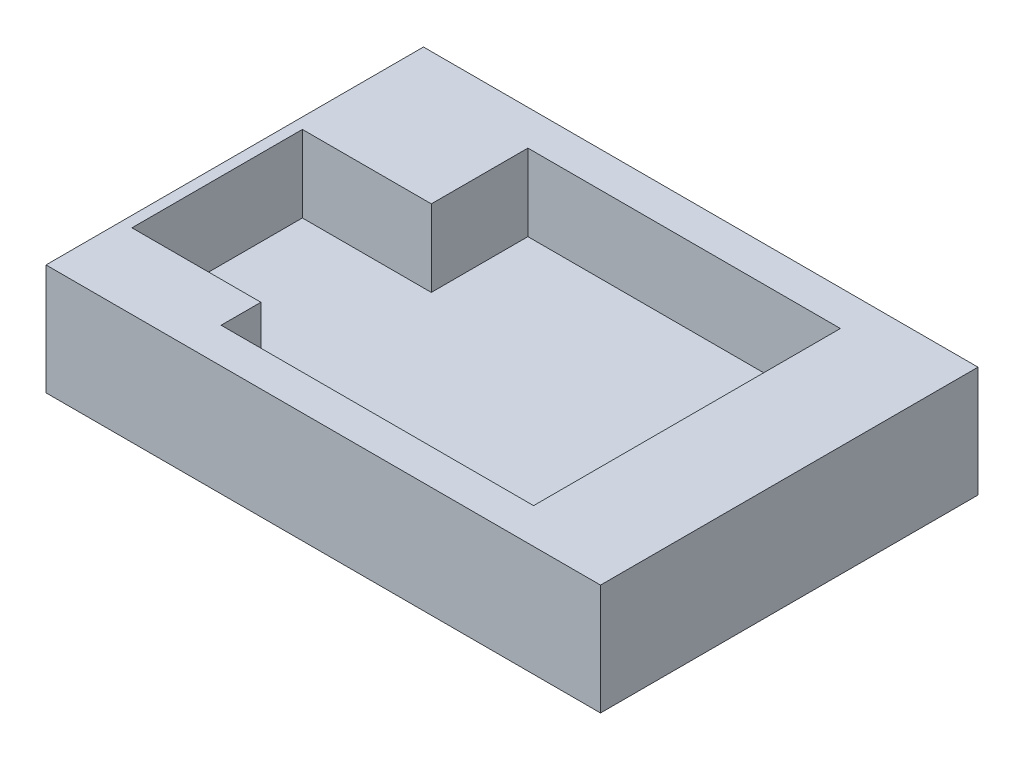
ISO-10303-21;
HEADER;
FILE_DESCRIPTION(('STEP AP214'),'2;1');
FILE_NAME('part.step','',(''),(''),'','','');
FILE_SCHEMA(('AUTOMOTIVE_DESIGN { 1 0 10303 214 1 1 1 1 }'));
ENDSEC;
DATA;
#1=APPLICATION_CONTEXT('core data for automotive mechanical design processes');
#2=APPLICATION_PROTOCOL_DEFINITION('international standard','automotive_design',2000,#1);
#3=PRODUCT_CONTEXT('',#1,'mechanical');
#4=PRODUCT('Part','Part','',(#3));
#5=PRODUCT_RELATED_PRODUCT_CATEGORY('part','',(#4));
#6=PRODUCT_DEFINITION_FORMATION('','',#4);
#7=PRODUCT_DEFINITION_CONTEXT('part definition',#1,'design');
#8=PRODUCT_DEFINITION('design','',#6,#7);
#9=PRODUCT_DEFINITION_SHAPE('','',#8);
#10=(LENGTH_UNIT() NAMED_UNIT(*) SI_UNIT(.MILLI.,.METRE.));
#11=(NAMED_UNIT(*) PLANE_ANGLE_UNIT() SI_UNIT($,.RADIAN.));
#12=(NAMED_UNIT(*) SI_UNIT($,.STERADIAN.) SOLID_ANGLE_UNIT());
#13=UNCERTAINTY_MEASURE_WITH_UNIT(LENGTH_MEASURE(1.E-05),#10,'distance_accuracy_value','');
#14=(GEOMETRIC_REPRESENTATION_CONTEXT(3) GLOBAL_UNCERTAINTY_ASSIGNED_CONTEXT((#13)) GLOBAL_UNIT_ASSIGNED_CONTEXT((#10,
#11,#12)) REPRESENTATION_CONTEXT('',''));
#15=CARTESIAN_POINT('',(0.,0.,0.));
#16=DIRECTION('',(0.,0.,1.));
#17=DIRECTION('',(1.,0.,0.));
#18=AXIS2_PLACEMENT_3D('',#15,#16,#17);
#19=CARTESIAN_POINT('',(-24.2,19.5,0.));
#20=DIRECTION('',(1.,0.,0.));
#21=DIRECTION('',(0.,0.,-1.));
#22=AXIS2_PLACEMENT_3D('',#19,#20,#21);
#23=PLANE('',#22);
#24=DIRECTION('',(0.,1.,0.));
#25=VECTOR('',#24,1.);
#26=CARTESIAN_POINT('',(-24.2,19.5,-10.));
#27=LINE('',#26,#25);
#28=CARTESIAN_POINT('',(-24.2,6.,-10.));
#29=VERTEX_POINT('',#28);
#30=CARTESIAN_POINT('',(-24.2,19.5,-10.));
#31=VERTEX_POINT('',#30);
#32=EDGE_CURVE('E155',#29,#31,#27,.T.);
#33=ORIENTED_EDGE('',*,*,#32,.F.);
#34=DIRECTION('',(0.,0.,1.));
#35=VECTOR('',#34,1.);
#36=CARTESIAN_POINT('',(-24.2,6.,0.));
#37=LINE('',#36,#35);
#38=CARTESIAN_POINT('',(-24.2,6.,-27.));
#39=VERTEX_POINT('',#38);
#40=EDGE_CURVE('E59',#39,#29,#37,.T.);
#41=ORIENTED_EDGE('',*,*,#40,.F.);
#42=DIRECTION('',(0.,-1.,0.));
#43=VECTOR('',#42,1.);
#44=CARTESIAN_POINT('',(-24.2,19.5,-27.));
#45=LINE('',#44,#43);
#46=CARTESIAN_POINT('',(-24.2,19.5,-27.));
#47=VERTEX_POINT('',#46);
#48=EDGE_CURVE('E195',#47,#39,#45,.T.);
#49=ORIENTED_EDGE('',*,*,#48,.F.);
#50=DIRECTION('',(0.,0.,1.));
#51=VECTOR('',#50,1.);
#52=CARTESIAN_POINT('',(-24.2,19.5,0.));
#53=LINE('',#52,#51);
#54=EDGE_CURVE('E166',#47,#31,#53,.T.);
#55=ORIENTED_EDGE('',*,*,#54,.T.);
#56=EDGE_LOOP('',(#33,#41,#49,#55));
#57=FACE_BOUND('',#56,.T.);
#58=ADVANCED_FACE('F36',(#57),#23,.T.);
#59=CARTESIAN_POINT('',(-48.8,6.,-33.218726945));
#60=DIRECTION('',(1.,0.,0.));
#61=DIRECTION('',(0.,0.,-1.));
#62=AXIS2_PLACEMENT_3D('',#59,#60,#61);
#63=PLANE('',#62);
#64=DIRECTION('',(0.,0.,1.));
#65=VECTOR('',#64,1.);
#66=CARTESIAN_POINT('',(-48.8,0.,-33.218726945));
#67=LINE('',#66,#65);
#68=CARTESIAN_POINT('',(-48.8,0.,-33.218726945));
#69=VERTEX_POINT('',#68);
#70=CARTESIAN_POINT('',(-48.8,0.,33.218726945));
#71=VERTEX_POINT('',#70);
#72=EDGE_CURVE('E202',#69,#71,#67,.T.);
#73=ORIENTED_EDGE('',*,*,#72,.T.);
#74=DIRECTION('',(0.,-1.,0.));
#75=VECTOR('',#74,1.);
#76=CARTESIAN_POINT('',(-48.8,6.,33.218726945));
#77=LINE('',#76,#75);
#78=CARTESIAN_POINT('',(-48.8,19.5,33.218726945));
#79=VERTEX_POINT('',#78);
#80=EDGE_CURVE('E11',#79,#71,#77,.T.);
#81=ORIENTED_EDGE('',*,*,#80,.F.);
#82=DIRECTION('',(0.,0.,1.));
#83=VECTOR('',#82,1.);
#84=CARTESIAN_POINT('',(-48.8,19.5,0.));
#85=LINE('',#84,#83);
#86=CARTESIAN_POINT('',(-48.8,19.5,-33.218726945));
#87=VERTEX_POINT('',#86);
#88=EDGE_CURVE('E172',#87,#79,#85,.T.);
#89=ORIENTED_EDGE('',*,*,#88,.F.);
#90=DIRECTION('',(0.,-1.,0.));
#91=VECTOR('',#90,1.);
#92=CARTESIAN_POINT('',(-48.8,6.,-33.218726945));
#93=LINE('',#92,#91);
#94=EDGE_CURVE('E211',#87,#69,#93,.T.);
#95=ORIENTED_EDGE('',*,*,#94,.T.);
#96=EDGE_LOOP('',(#73,#81,#89,#95));
#97=FACE_BOUND('',#96,.T.);
#98=ADVANCED_FACE('F38',(#97),#63,.F.);
#99=CARTESIAN_POINT('',(48.8,6.,33.218726945));
#100=DIRECTION('',(0.,0.,-1.));
#101=DIRECTION('',(-1.,0.,0.));
#102=AXIS2_PLACEMENT_3D('',#99,#100,#101);
#103=PLANE('',#102);
#104=DIRECTION('',(1.,0.,0.));
#105=VECTOR('',#104,1.);
#106=CARTESIAN_POINT('',(48.8,0.,33.218726945));
#107=LINE('',#106,#105);
#108=CARTESIAN_POINT('',(48.8,0.,33.218726945));
#109=VERTEX_POINT('',#108);
#110=EDGE_CURVE('E205',#71,#109,#107,.T.);
#111=ORIENTED_EDGE('',*,*,#110,.T.);
#112=DIRECTION('',(0.,-1.,0.));
#113=VECTOR('',#112,1.);
#114=CARTESIAN_POINT('',(48.8,6.,33.218726945));
#115=LINE('',#114,#113);
#116=CARTESIAN_POINT('',(48.8,19.5,33.218726945));
#117=VERTEX_POINT('',#116);
#118=EDGE_CURVE('E44',#117,#109,#115,.T.);
#119=ORIENTED_EDGE('',*,*,#118,.F.);
#120=DIRECTION('',(1.,0.,0.));
#121=VECTOR('',#120,1.);
#122=CARTESIAN_POINT('',(0.,19.5,33.218726945));
#123=LINE('',#122,#121);
#124=EDGE_CURVE('E175',#79,#117,#123,.T.);
#125=ORIENTED_EDGE('',*,*,#124,.F.);
#126=ORIENTED_EDGE('',*,*,#80,.T.);
#127=EDGE_LOOP('',(#111,#119,#125,#126));
#128=FACE_BOUND('',#127,.T.);
#129=ADVANCED_FACE('F234',(#128),#103,.F.);
#130=CARTESIAN_POINT('',(48.8,6.,-33.218726945));
#131=DIRECTION('',(-1.,0.,0.));
#132=DIRECTION('',(0.,0.,1.));
#133=AXIS2_PLACEMENT_3D('',#130,#131,#132);
#134=PLANE('',#133);
#135=DIRECTION('',(0.,0.,-1.));
#136=VECTOR('',#135,1.);
#137=CARTESIAN_POINT('',(48.8,0.,-33.218726945));
#138=LINE('',#137,#136);
#139=CARTESIAN_POINT('',(48.8,0.,-33.218726945));
#140=VERTEX_POINT('',#139);
#141=EDGE_CURVE('E207',#109,#140,#138,.T.);
#142=ORIENTED_EDGE('',*,*,#141,.T.);
#143=DIRECTION('',(0.,-1.,0.));
#144=VECTOR('',#143,1.);
#145=CARTESIAN_POINT('',(48.8,6.,-33.218726945));
#146=LINE('',#145,#144);
#147=CARTESIAN_POINT('',(48.8,19.5,-33.218726945));
#148=VERTEX_POINT('',#147);
#149=EDGE_CURVE('E214',#148,#140,#146,.T.);
#150=ORIENTED_EDGE('',*,*,#149,.F.);
#151=DIRECTION('',(0.,0.,-1.));
#152=VECTOR('',#151,1.);
#153=CARTESIAN_POINT('',(48.8,19.5,0.));
#154=LINE('',#153,#152);
#155=EDGE_CURVE('E178',#117,#148,#154,.T.);
#156=ORIENTED_EDGE('',*,*,#155,.F.);
#157=ORIENTED_EDGE('',*,*,#118,.T.);
#158=EDGE_LOOP('',(#142,#150,#156,#157));
#159=FACE_BOUND('',#158,.T.);
#160=ADVANCED_FACE('F220',(#159),#134,.F.);
#161=CARTESIAN_POINT('',(48.8,6.,-33.218726945));
#162=DIRECTION('',(0.,0.,1.));
#163=DIRECTION('',(1.,0.,0.));
#164=AXIS2_PLACEMENT_3D('',#161,#162,#163);
#165=PLANE('',#164);
#166=DIRECTION('',(-1.,0.,0.));
#167=VECTOR('',#166,1.);
#168=CARTESIAN_POINT('',(48.8,0.,-33.218726945));
#169=LINE('',#168,#167);
#170=EDGE_CURVE('E209',#140,#69,#169,.T.);
#171=ORIENTED_EDGE('',*,*,#170,.T.);
#172=ORIENTED_EDGE('',*,*,#94,.F.);
#173=DIRECTION('',(-1.,0.,0.));
#174=VECTOR('',#173,1.);
#175=CARTESIAN_POINT('',(0.,19.5,-33.218726945));
#176=LINE('',#175,#174);
#177=EDGE_CURVE('E181',#148,#87,#176,.T.);
#178=ORIENTED_EDGE('',*,*,#177,.F.);
#179=ORIENTED_EDGE('',*,*,#149,.T.);
#180=EDGE_LOOP('',(#171,#172,#178,#179));
#181=FACE_BOUND('',#180,.T.);
#182=ADVANCED_FACE('F228',(#181),#165,.F.);
#183=CARTESIAN_POINT('',(0.,0.,0.));
#184=DIRECTION('',(0.,-1.,0.));
#185=DIRECTION('',(0.,0.,-1.));
#186=AXIS2_PLACEMENT_3D('',#183,#184,#185);
#187=PLANE('',#186);
#188=ORIENTED_EDGE('',*,*,#72,.F.);
#189=ORIENTED_EDGE('',*,*,#170,.F.);
#190=ORIENTED_EDGE('',*,*,#141,.F.);
#191=ORIENTED_EDGE('',*,*,#110,.F.);
#192=EDGE_LOOP('',(#188,#189,#190,#191));
#193=FACE_BOUND('',#192,.T.);
#194=ADVANCED_FACE('F226',(#193),#187,.T.);
#195=CARTESIAN_POINT('',(30.8,19.5,0.));
#196=DIRECTION('',(-1.,0.,0.));
#197=DIRECTION('',(0.,0.,1.));
#198=AXIS2_PLACEMENT_3D('',#195,#196,#197);
#199=PLANE('',#198);
#200=DIRECTION('',(0.,0.,-1.));
#201=VECTOR('',#200,1.);
#202=CARTESIAN_POINT('',(30.8,6.,0.));
#203=LINE('',#202,#201);
#204=CARTESIAN_POINT('',(30.8,6.,27.));
#205=VERTEX_POINT('',#204);
#206=CARTESIAN_POINT('',(30.8,6.,-27.));
#207=VERTEX_POINT('',#206);
#208=EDGE_CURVE('E157',#205,#207,#203,.T.);
#209=ORIENTED_EDGE('',*,*,#208,.F.);
#210=DIRECTION('',(0.,-1.,0.));
#211=VECTOR('',#210,1.);
#212=CARTESIAN_POINT('',(30.8,19.5,27.));
#213=LINE('',#212,#211);
#214=CARTESIAN_POINT('',(30.8,19.5,27.));
#215=VERTEX_POINT('',#214);
#216=EDGE_CURVE('E200',#215,#205,#213,.T.);
#217=ORIENTED_EDGE('',*,*,#216,.F.);
#218=DIRECTION('',(0.,0.,-1.));
#219=VECTOR('',#218,1.);
#220=CARTESIAN_POINT('',(30.8,19.5,0.));
#221=LINE('',#220,#219);
#222=CARTESIAN_POINT('',(30.8,19.5,-27.));
#223=VERTEX_POINT('',#222);
#224=EDGE_CURVE('E158',#215,#223,#221,.T.);
#225=ORIENTED_EDGE('',*,*,#224,.T.);
#226=DIRECTION('',(0.,-1.,0.));
#227=VECTOR('',#226,1.);
#228=CARTESIAN_POINT('',(30.8,19.5,-27.));
#229=LINE('',#228,#227);
#230=EDGE_CURVE('E184',#223,#207,#229,.T.);
#231=ORIENTED_EDGE('',*,*,#230,.T.);
#232=EDGE_LOOP('',(#209,#217,#225,#231));
#233=FACE_BOUND('',#232,.T.);
#234=ADVANCED_FACE('F257',(#233),#199,.T.);
#235=CARTESIAN_POINT('',(0.,19.5,27.));
#236=DIRECTION('',(0.,0.,1.));
#237=DIRECTION('',(1.,0.,0.));
#238=AXIS2_PLACEMENT_3D('',#235,#236,#237);
#239=PLANE('',#238);
#240=DIRECTION('',(-1.,0.,0.));
#241=VECTOR('',#240,1.);
#242=CARTESIAN_POINT('',(0.,6.,27.));
#243=LINE('',#242,#241);
#244=CARTESIAN_POINT('',(-24.2,6.,27.));
#245=VERTEX_POINT('',#244);
#246=EDGE_CURVE('E187',#205,#245,#243,.T.);
#247=ORIENTED_EDGE('',*,*,#246,.T.);
#248=DIRECTION('',(0.,-1.,0.));
#249=VECTOR('',#248,1.);
#250=CARTESIAN_POINT('',(-24.2,19.5,27.));
#251=LINE('',#250,#249);
#252=CARTESIAN_POINT('',(-24.2,19.5,27.));
#253=VERTEX_POINT('',#252);
#254=EDGE_CURVE('E197',#253,#245,#251,.T.);
#255=ORIENTED_EDGE('',*,*,#254,.F.);
#256=DIRECTION('',(-1.,0.,0.));
#257=VECTOR('',#256,1.);
#258=CARTESIAN_POINT('',(0.,19.5,27.));
#259=LINE('',#258,#257);
#260=EDGE_CURVE('E161',#215,#253,#259,.T.);
#261=ORIENTED_EDGE('',*,*,#260,.F.);
#262=ORIENTED_EDGE('',*,*,#216,.T.);
#263=EDGE_LOOP('',(#247,#255,#261,#262));
#264=FACE_BOUND('',#263,.T.);
#265=ADVANCED_FACE('F250',(#264),#239,.F.);
#266=DIRECTION('',(0.,-1.,0.));
#267=VECTOR('',#266,1.);
#268=CARTESIAN_POINT('',(-24.2,19.5,20.));
#269=LINE('',#268,#267);
#270=CARTESIAN_POINT('',(-24.2,19.5,20.));
#271=VERTEX_POINT('',#270);
#272=CARTESIAN_POINT('',(-24.2,6.,20.));
#273=VERTEX_POINT('',#272);
#274=EDGE_CURVE('E139',#271,#273,#269,.T.);
#275=ORIENTED_EDGE('',*,*,#274,.F.);
#276=EDGE_CURVE('E165',#271,#253,#53,.T.);
#277=ORIENTED_EDGE('',*,*,#276,.T.);
#278=ORIENTED_EDGE('',*,*,#254,.T.);
#279=EDGE_CURVE('E190',#273,#245,#37,.T.);
#280=ORIENTED_EDGE('',*,*,#279,.F.);
#281=EDGE_LOOP('',(#275,#277,#278,#280));
#282=FACE_BOUND('',#281,.T.);
#283=ADVANCED_FACE('F243',(#282),#23,.T.);
#284=CARTESIAN_POINT('',(0.,19.5,-27.));
#285=DIRECTION('',(0.,0.,1.));
#286=DIRECTION('',(1.,0.,0.));
#287=AXIS2_PLACEMENT_3D('',#284,#285,#286);
#288=PLANE('',#287);
#289=DIRECTION('',(-1.,0.,0.));
#290=VECTOR('',#289,1.);
#291=CARTESIAN_POINT('',(0.,6.,-27.));
#292=LINE('',#291,#290);
#293=EDGE_CURVE('E162',#207,#39,#292,.T.);
#294=ORIENTED_EDGE('',*,*,#293,.F.);
#295=ORIENTED_EDGE('',*,*,#230,.F.);
#296=DIRECTION('',(-1.,0.,0.));
#297=VECTOR('',#296,1.);
#298=CARTESIAN_POINT('',(0.,19.5,-27.));
#299=LINE('',#298,#297);
#300=EDGE_CURVE('E169',#223,#47,#299,.T.);
#301=ORIENTED_EDGE('',*,*,#300,.T.);
#302=ORIENTED_EDGE('',*,*,#48,.T.);
#303=EDGE_LOOP('',(#294,#295,#301,#302));
#304=FACE_BOUND('',#303,.T.);
#305=ADVANCED_FACE('F249',(#304),#288,.T.);
#306=CARTESIAN_POINT('',(0.,19.5,0.));
#307=DIRECTION('',(0.,1.,0.));
#308=DIRECTION('',(0.,0.,1.));
#309=AXIS2_PLACEMENT_3D('',#306,#307,#308);
#310=PLANE('',#309);
#311=DIRECTION('',(-1.,0.,0.));
#312=VECTOR('',#311,1.);
#313=CARTESIAN_POINT('',(-46.8935652565534,19.5,-10.));
#314=LINE('',#313,#312);
#315=CARTESIAN_POINT('',(-46.8935652565534,19.5,-10.));
#316=VERTEX_POINT('',#315);
#317=EDGE_CURVE('E145',#31,#316,#314,.T.);
#318=ORIENTED_EDGE('',*,*,#317,.F.);
#319=ORIENTED_EDGE('',*,*,#54,.F.);
#320=ORIENTED_EDGE('',*,*,#300,.F.);
#321=ORIENTED_EDGE('',*,*,#224,.F.);
#322=ORIENTED_EDGE('',*,*,#260,.T.);
#323=ORIENTED_EDGE('',*,*,#276,.F.);
#324=DIRECTION('',(1.,0.,0.));
#325=VECTOR('',#324,1.);
#326=CARTESIAN_POINT('',(-46.8935652565534,19.5,20.));
#327=LINE('',#326,#325);
#328=CARTESIAN_POINT('',(-46.8935652565534,19.5,20.));
#329=VERTEX_POINT('',#328);
#330=EDGE_CURVE('E147',#329,#271,#327,.T.);
#331=ORIENTED_EDGE('',*,*,#330,.F.);
#332=DIRECTION('',(0.,0.,1.));
#333=VECTOR('',#332,1.);
#334=CARTESIAN_POINT('',(-46.8935652565534,19.5,20.));
#335=LINE('',#334,#333);
#336=EDGE_CURVE('E51',#316,#329,#335,.T.);
#337=ORIENTED_EDGE('',*,*,#336,.F.);
#338=EDGE_LOOP('',(#318,#319,#320,#321,#322,#323,#331,#337));
#339=FACE_BOUND('',#338,.T.);
#340=ORIENTED_EDGE('',*,*,#88,.T.);
#341=ORIENTED_EDGE('',*,*,#124,.T.);
#342=ORIENTED_EDGE('',*,*,#155,.T.);
#343=ORIENTED_EDGE('',*,*,#177,.T.);
#344=EDGE_LOOP('',(#340,#341,#342,#343));
#345=FACE_BOUND('',#344,.T.);
#346=ADVANCED_FACE('F233',(#339,#345),#310,.T.);
#347=CARTESIAN_POINT('',(0.,6.,0.));
#348=DIRECTION('',(0.,-1.,0.));
#349=DIRECTION('',(0.,0.,-1.));
#350=AXIS2_PLACEMENT_3D('',#347,#348,#349);
#351=PLANE('',#350);
#352=ORIENTED_EDGE('',*,*,#40,.T.);
#353=DIRECTION('',(-1.,0.,0.));
#354=VECTOR('',#353,1.);
#355=CARTESIAN_POINT('',(-46.8935652565534,6.,-10.));
#356=LINE('',#355,#354);
#357=CARTESIAN_POINT('',(-46.8935652565534,6.,-10.));
#358=VERTEX_POINT('',#357);
#359=EDGE_CURVE('E133',#29,#358,#356,.T.);
#360=ORIENTED_EDGE('',*,*,#359,.T.);
#361=DIRECTION('',(0.,0.,1.));
#362=VECTOR('',#361,1.);
#363=CARTESIAN_POINT('',(-46.8935652565534,6.,20.));
#364=LINE('',#363,#362);
#365=CARTESIAN_POINT('',(-46.8935652565534,6.,20.));
#366=VERTEX_POINT('',#365);
#367=EDGE_CURVE('E129',#358,#366,#364,.T.);
#368=ORIENTED_EDGE('',*,*,#367,.T.);
#369=DIRECTION('',(1.,0.,0.));
#370=VECTOR('',#369,1.);
#371=CARTESIAN_POINT('',(-46.8935652565534,6.,20.));
#372=LINE('',#371,#370);
#373=EDGE_CURVE('E136',#366,#273,#372,.T.);
#374=ORIENTED_EDGE('',*,*,#373,.T.);
#375=ORIENTED_EDGE('',*,*,#279,.T.);
#376=ORIENTED_EDGE('',*,*,#246,.F.);
#377=ORIENTED_EDGE('',*,*,#208,.T.);
#378=ORIENTED_EDGE('',*,*,#293,.T.);
#379=EDGE_LOOP('',(#352,#360,#368,#374,#375,#376,#377,#378));
#380=FACE_BOUND('',#379,.T.);
#381=ADVANCED_FACE('F143',(#380),#351,.F.);
#382=CARTESIAN_POINT('',(-46.8935652565534,6.,20.));
#383=DIRECTION('',(-1.,0.,0.));
#384=DIRECTION('',(0.,0.,1.));
#385=AXIS2_PLACEMENT_3D('',#382,#383,#384);
#386=PLANE('',#385);
#387=ORIENTED_EDGE('',*,*,#336,.T.);
#388=DIRECTION('',(0.,1.,0.));
#389=VECTOR('',#388,1.);
#390=CARTESIAN_POINT('',(-46.8935652565534,6.,20.));
#391=LINE('',#390,#389);
#392=EDGE_CURVE('E125',#366,#329,#391,.T.);
#393=ORIENTED_EDGE('',*,*,#392,.F.);
#394=ORIENTED_EDGE('',*,*,#367,.F.);
#395=DIRECTION('',(0.,1.,0.));
#396=VECTOR('',#395,1.);
#397=CARTESIAN_POINT('',(-46.8935652565534,6.,-10.));
#398=LINE('',#397,#396);
#399=EDGE_CURVE('E132',#358,#316,#398,.T.);
#400=ORIENTED_EDGE('',*,*,#399,.T.);
#401=EDGE_LOOP('',(#387,#393,#394,#400));
#402=FACE_BOUND('',#401,.T.);
#403=ADVANCED_FACE('F127',(#402),#386,.F.);
#404=CARTESIAN_POINT('',(-46.8935652565534,6.,-10.));
#405=DIRECTION('',(0.,0.,-1.));
#406=DIRECTION('',(-1.,0.,0.));
#407=AXIS2_PLACEMENT_3D('',#404,#405,#406);
#408=PLANE('',#407);
#409=ORIENTED_EDGE('',*,*,#32,.T.);
#410=ORIENTED_EDGE('',*,*,#317,.T.);
#411=ORIENTED_EDGE('',*,*,#399,.F.);
#412=ORIENTED_EDGE('',*,*,#359,.F.);
#413=EDGE_LOOP('',(#409,#410,#411,#412));
#414=FACE_BOUND('',#413,.T.);
#415=ADVANCED_FACE('F272',(#414),#408,.F.);
#416=CARTESIAN_POINT('',(-46.8935652565534,6.,20.));
#417=DIRECTION('',(0.,0.,1.));
#418=DIRECTION('',(1.,0.,0.));
#419=AXIS2_PLACEMENT_3D('',#416,#417,#418);
#420=PLANE('',#419);
#421=ORIENTED_EDGE('',*,*,#274,.T.);
#422=ORIENTED_EDGE('',*,*,#373,.F.);
#423=ORIENTED_EDGE('',*,*,#392,.T.);
#424=ORIENTED_EDGE('',*,*,#330,.T.);
#425=EDGE_LOOP('',(#421,#422,#423,#424));
#426=FACE_BOUND('',#425,.T.);
#427=ADVANCED_FACE('F137',(#426),#420,.F.);
#428=CLOSED_SHELL('',(#58,#98,#129,#160,#182,#194,#234,#265,#283,#305,#346,#381,#403,#415,#427));
#429=MANIFOLD_SOLID_BREP('B2',#428);
#430=ADVANCED_BREP_SHAPE_REPRESENTATION('',(#18,#429),#14);
#431=SHAPE_DEFINITION_REPRESENTATION(#9,#430);
ENDSEC;
END-ISO-10303-21;
